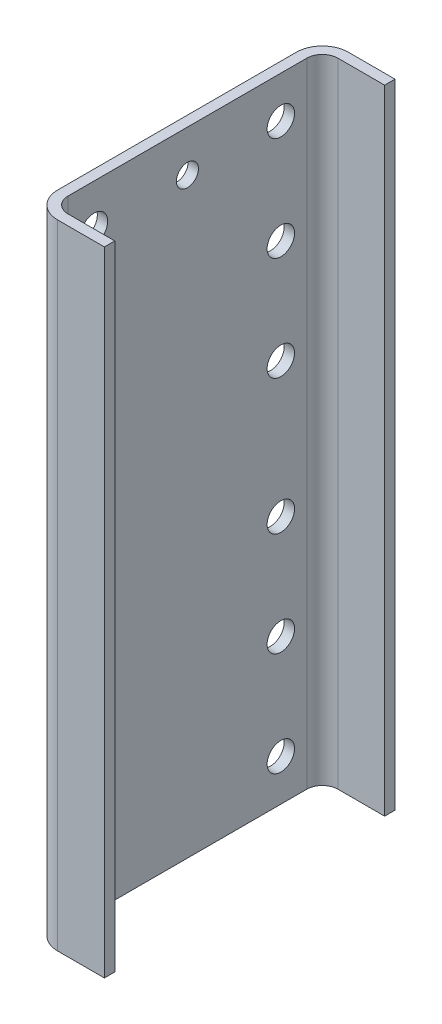
ISO-10303-21;
HEADER;
FILE_DESCRIPTION(('STEP AP214'),'2;1');
FILE_NAME('part.step','',(''),(''),'','','');
FILE_SCHEMA(('AUTOMOTIVE_DESIGN { 1 0 10303 214 1 1 1 1 }'));
ENDSEC;
DATA;
#1=APPLICATION_CONTEXT('core data for automotive mechanical design processes');
#2=APPLICATION_PROTOCOL_DEFINITION('international standard','automotive_design',2000,#1);
#3=PRODUCT_CONTEXT('',#1,'mechanical');
#4=PRODUCT('Part','Part','',(#3));
#5=PRODUCT_RELATED_PRODUCT_CATEGORY('part','',(#4));
#6=PRODUCT_DEFINITION_FORMATION('','',#4);
#7=PRODUCT_DEFINITION_CONTEXT('part definition',#1,'design');
#8=PRODUCT_DEFINITION('design','',#6,#7);
#9=PRODUCT_DEFINITION_SHAPE('','',#8);
#10=(LENGTH_UNIT() NAMED_UNIT(*) SI_UNIT(.MILLI.,.METRE.));
#11=(NAMED_UNIT(*) PLANE_ANGLE_UNIT() SI_UNIT($,.RADIAN.));
#12=(NAMED_UNIT(*) SI_UNIT($,.STERADIAN.) SOLID_ANGLE_UNIT());
#13=UNCERTAINTY_MEASURE_WITH_UNIT(LENGTH_MEASURE(1.E-05),#10,'distance_accuracy_value','');
#14=(GEOMETRIC_REPRESENTATION_CONTEXT(3) GLOBAL_UNCERTAINTY_ASSIGNED_CONTEXT((#13)) GLOBAL_UNIT_ASSIGNED_CONTEXT((#10,
#11,#12)) REPRESENTATION_CONTEXT('',''));
#15=CARTESIAN_POINT('',(0.,0.,0.));
#16=DIRECTION('',(0.,0.,1.));
#17=DIRECTION('',(1.,0.,0.));
#18=AXIS2_PLACEMENT_3D('',#15,#16,#17);
#19=CARTESIAN_POINT('',(3.38618022510673E-12,193.675000000002,73.0249999999997));
#20=DIRECTION('',(1.00000000000001,0.,0.));
#21=DIRECTION('',(0.,0.,-1.00000000000001));
#22=AXIS2_PLACEMENT_3D('',#19,#20,#21);
#23=PLANE('',#22);
#24=CARTESIAN_POINT('',(1.38777878078145E-12,168.275,57.1500000000003));
#25=DIRECTION('',(1.00000000000001,0.,0.));
#26=DIRECTION('',(0.,0.,1.00000000000001));
#27=AXIS2_PLACEMENT_3D('',#24,#25,#26);
#28=CIRCLE('',#27,8.38200000000002);
#29=CARTESIAN_POINT('',(1.38807562499457E-12,168.275,65.5320000000003));
#30=VERTEX_POINT('',#29);
#31=EDGE_CURVE('E261',#30,#30,#28,.T.);
#32=ORIENTED_EDGE('',*,*,#31,.T.);
#33=EDGE_LOOP('',(#32));
#34=FACE_BOUND('',#33,.T.);
#35=CARTESIAN_POINT('',(4.9960036108132E-13,41.2750000000001,57.15));
#36=DIRECTION('',(1.00000000000001,0.,0.));
#37=DIRECTION('',(0.,0.,1.00000000000001));
#38=AXIS2_PLACEMENT_3D('',#35,#36,#37);
#39=CIRCLE('',#38,8.38200000000002);
#40=CARTESIAN_POINT('',(4.99897205294446E-13,41.2750000000001,65.5320000000001));
#41=VERTEX_POINT('',#40);
#42=EDGE_CURVE('E255',#41,#41,#39,.T.);
#43=ORIENTED_EDGE('',*,*,#42,.T.);
#44=EDGE_LOOP('',(#43));
#45=FACE_BOUND('',#44,.T.);
#46=CARTESIAN_POINT('',(4.9960036108132E-13,-104.775000000001,57.15));
#47=DIRECTION('',(1.00000000000001,0.,0.));
#48=DIRECTION('',(0.,0.,1.00000000000001));
#49=AXIS2_PLACEMENT_3D('',#46,#47,#48);
#50=CIRCLE('',#49,8.38200000000001);
#51=CARTESIAN_POINT('',(4.99897205294446E-13,-104.775000000001,65.5320000000001));
#52=VERTEX_POINT('',#51);
#53=EDGE_CURVE('E247',#52,#52,#50,.T.);
#54=ORIENTED_EDGE('',*,*,#53,.T.);
#55=EDGE_LOOP('',(#54));
#56=FACE_BOUND('',#55,.T.);
#57=CARTESIAN_POINT('',(4.9960036108132E-13,-168.275000000001,-57.1500000000023));
#58=DIRECTION('',(1.00000000000001,0.,0.));
#59=DIRECTION('',(0.,0.,-1.00000000000001));
#60=AXIS2_PLACEMENT_3D('',#57,#58,#59);
#61=CIRCLE('',#60,8.38200000000002);
#62=CARTESIAN_POINT('',(4.99303516868195E-13,-168.275000000001,-65.5320000000023));
#63=VERTEX_POINT('',#62);
#64=EDGE_CURVE('E239',#63,#63,#61,.T.);
#65=ORIENTED_EDGE('',*,*,#64,.T.);
#66=EDGE_LOOP('',(#65));
#67=FACE_BOUND('',#66,.T.);
#68=CARTESIAN_POINT('',(-1.66533453693773E-13,-41.275,-57.1500000000003));
#69=DIRECTION('',(1.00000000000001,0.,0.));
#70=DIRECTION('',(0.,0.,-1.00000000000001));
#71=AXIS2_PLACEMENT_3D('',#68,#69,#70);
#72=CIRCLE('',#71,8.382);
#73=CARTESIAN_POINT('',(-1.66830297906899E-13,-41.275,-65.5320000000003));
#74=VERTEX_POINT('',#73);
#75=EDGE_CURVE('E231',#74,#74,#72,.T.);
#76=ORIENTED_EDGE('',*,*,#75,.T.);
#77=EDGE_LOOP('',(#76));
#78=FACE_BOUND('',#77,.T.);
#79=CARTESIAN_POINT('',(4.9960036108132E-13,104.775000000001,-57.1500000000023));
#80=DIRECTION('',(1.00000000000001,0.,0.));
#81=DIRECTION('',(0.,0.,-1.00000000000001));
#82=AXIS2_PLACEMENT_3D('',#79,#80,#81);
#83=CIRCLE('',#82,8.38200000000001);
#84=CARTESIAN_POINT('',(4.99303516868195E-13,104.775000000001,-65.5320000000023));
#85=VERTEX_POINT('',#84);
#86=EDGE_CURVE('E223',#85,#85,#83,.T.);
#87=ORIENTED_EDGE('',*,*,#86,.T.);
#88=EDGE_LOOP('',(#87));
#89=FACE_BOUND('',#88,.T.);
#90=DIRECTION('',(0.,-1.00000000000001,0.));
#91=VECTOR('',#90,1.);
#92=CARTESIAN_POINT('',(2.94209101525666E-12,193.675000000002,-73.0249999999995));
#93=LINE('',#92,#91);
#94=CARTESIAN_POINT('',(2.94209101525666E-12,193.675000000002,-73.0249999999995));
#95=VERTEX_POINT('',#94);
#96=CARTESIAN_POINT('',(-3.88578058618805E-13,-193.675000000002,-73.0250000000017));
#97=VERTEX_POINT('',#96);
#98=EDGE_CURVE('E11',#95,#97,#93,.T.);
#99=ORIENTED_EDGE('',*,*,#98,.T.);
#100=DIRECTION('',(0.,0.,1.00000000000001));
#101=VECTOR('',#100,1.);
#102=CARTESIAN_POINT('',(-1.66533453693773E-13,-193.675000000002,73.0249999999972));
#103=LINE('',#102,#101);
#104=CARTESIAN_POINT('',(-1.66533453693773E-13,-193.675000000002,73.0249999999972));
#105=VERTEX_POINT('',#104);
#106=EDGE_CURVE('E127',#97,#105,#103,.T.);
#107=ORIENTED_EDGE('',*,*,#106,.T.);
#108=DIRECTION('',(0.,-1.00000000000001,0.));
#109=VECTOR('',#108,1.);
#110=CARTESIAN_POINT('',(3.38618022510673E-12,193.675000000002,73.0249999999997));
#111=LINE('',#110,#109);
#112=CARTESIAN_POINT('',(3.38618022510673E-12,193.675000000002,73.0249999999997));
#113=VERTEX_POINT('',#112);
#114=EDGE_CURVE('E43',#113,#105,#111,.T.);
#115=ORIENTED_EDGE('',*,*,#114,.F.);
#116=DIRECTION('',(0.,0.,1.00000000000001));
#117=VECTOR('',#116,1.);
#118=CARTESIAN_POINT('',(3.38618022510673E-12,193.675000000002,73.0249999999997));
#119=LINE('',#118,#117);
#120=EDGE_CURVE('E128',#95,#113,#119,.T.);
#121=ORIENTED_EDGE('',*,*,#120,.F.);
#122=EDGE_LOOP('',(#99,#107,#115,#121));
#123=FACE_BOUND('',#122,.T.);
#124=CARTESIAN_POINT('',(4.9960036108132E-13,41.2749999999999,-57.15));
#125=DIRECTION('',(1.00000000000001,0.,0.));
#126=DIRECTION('',(0.,0.,-1.00000000000001));
#127=AXIS2_PLACEMENT_3D('',#124,#125,#126);
#128=CIRCLE('',#127,8.38200000000002);
#129=CARTESIAN_POINT('',(4.99303516868195E-13,41.2749999999999,-65.5320000000001));
#130=VERTEX_POINT('',#129);
#131=EDGE_CURVE('E147',#130,#130,#128,.T.);
#132=ORIENTED_EDGE('',*,*,#131,.T.);
#133=EDGE_LOOP('',(#132));
#134=FACE_BOUND('',#133,.T.);
#135=CARTESIAN_POINT('',(2.05391259555654E-12,168.275000000001,-57.1500000000003));
#136=DIRECTION('',(1.00000000000001,0.,0.));
#137=DIRECTION('',(0.,0.,-1.00000000000001));
#138=AXIS2_PLACEMENT_3D('',#135,#136,#137);
#139=CIRCLE('',#138,8.38200000000002);
#140=CARTESIAN_POINT('',(2.05361575134341E-12,168.275000000001,-65.5320000000003));
#141=VERTEX_POINT('',#140);
#142=EDGE_CURVE('E227',#141,#141,#139,.T.);
#143=ORIENTED_EDGE('',*,*,#142,.T.);
#144=EDGE_LOOP('',(#143));
#145=FACE_BOUND('',#144,.T.);
#146=CARTESIAN_POINT('',(4.9960036108132E-13,-104.775000000001,-57.1500000000023));
#147=DIRECTION('',(1.00000000000001,0.,0.));
#148=DIRECTION('',(0.,0.,-1.00000000000001));
#149=AXIS2_PLACEMENT_3D('',#146,#147,#148);
#150=CIRCLE('',#149,8.38200000000001);
#151=CARTESIAN_POINT('',(4.99303516868195E-13,-104.775000000001,-65.5320000000023));
#152=VERTEX_POINT('',#151);
#153=EDGE_CURVE('E235',#152,#152,#150,.T.);
#154=ORIENTED_EDGE('',*,*,#153,.T.);
#155=EDGE_LOOP('',(#154));
#156=FACE_BOUND('',#155,.T.);
#157=CARTESIAN_POINT('',(-1.66533453693773E-13,-168.275000000001,57.15));
#158=DIRECTION('',(1.00000000000001,0.,0.));
#159=DIRECTION('',(0.,0.,1.00000000000001));
#160=AXIS2_PLACEMENT_3D('',#157,#158,#159);
#161=CIRCLE('',#160,8.38200000000002);
#162=CARTESIAN_POINT('',(-1.66236609480648E-13,-168.275000000001,65.5320000000001));
#163=VERTEX_POINT('',#162);
#164=EDGE_CURVE('E243',#163,#163,#161,.T.);
#165=ORIENTED_EDGE('',*,*,#164,.T.);
#166=EDGE_LOOP('',(#165));
#167=FACE_BOUND('',#166,.T.);
#168=CARTESIAN_POINT('',(-1.66533453693773E-13,-41.2749999999997,57.1499999999998));
#169=DIRECTION('',(1.00000000000001,0.,0.));
#170=DIRECTION('',(0.,0.,1.00000000000001));
#171=AXIS2_PLACEMENT_3D('',#168,#169,#170);
#172=CIRCLE('',#171,8.382);
#173=CARTESIAN_POINT('',(-1.66236609480648E-13,-41.2749999999997,65.5319999999999));
#174=VERTEX_POINT('',#173);
#175=EDGE_CURVE('E251',#174,#174,#172,.T.);
#176=ORIENTED_EDGE('',*,*,#175,.T.);
#177=EDGE_LOOP('',(#176));
#178=FACE_BOUND('',#177,.T.);
#179=CARTESIAN_POINT('',(4.9960036108132E-13,104.775,57.15));
#180=DIRECTION('',(1.00000000000001,0.,0.));
#181=DIRECTION('',(0.,0.,1.00000000000001));
#182=AXIS2_PLACEMENT_3D('',#179,#180,#181);
#183=CIRCLE('',#182,8.38200000000001);
#184=CARTESIAN_POINT('',(4.99897205294446E-13,104.775,65.5320000000001));
#185=VERTEX_POINT('',#184);
#186=EDGE_CURVE('E258',#185,#185,#183,.T.);
#187=ORIENTED_EDGE('',*,*,#186,.T.);
#188=EDGE_LOOP('',(#187));
#189=FACE_BOUND('',#188,.T.);
#190=CARTESIAN_POINT('',(2.05391259555654E-12,168.275000000001,-2.22044604925031E-13));
#191=DIRECTION('',(1.00000000000001,0.,0.));
#192=DIRECTION('',(0.,0.,-1.00000000000001));
#193=AXIS2_PLACEMENT_3D('',#190,#191,#192);
#194=CIRCLE('',#193,6.731);
#195=CARTESIAN_POINT('',(2.05367422065812E-12,168.275000000001,-6.73100000000027));
#196=VERTEX_POINT('',#195);
#197=EDGE_CURVE('E271',#196,#196,#194,.T.);
#198=ORIENTED_EDGE('',*,*,#197,.T.);
#199=EDGE_LOOP('',(#198));
#200=FACE_BOUND('',#199,.T.);
#201=ADVANCED_FACE('F34',(#34,#45,#56,#67,#78,#89,#123,#134,#145,#156,#167,#178,#189,#200),#23,.F.);
#202=CARTESIAN_POINT('',(6.35000000000302,193.675000000002,-73.0249999999995));
#203=DIRECTION('',(-1.00000000000001,0.,0.));
#204=DIRECTION('',(0.,0.,1.00000000000001));
#205=AXIS2_PLACEMENT_3D('',#202,#203,#204);
#206=PLANE('',#205);
#207=CARTESIAN_POINT('',(6.35000000000147,168.275,57.1500000000003));
#208=DIRECTION('',(-1.00000000000001,0.,0.));
#209=DIRECTION('',(0.,0.,1.00000000000001));
#210=AXIS2_PLACEMENT_3D('',#207,#208,#209);
#211=CIRCLE('',#210,8.38200000000002);
#212=CARTESIAN_POINT('',(6.35000000000147,168.275,65.5320000000003));
#213=VERTEX_POINT('',#212);
#214=EDGE_CURVE('E259',#213,#213,#211,.F.);
#215=ORIENTED_EDGE('',*,*,#214,.F.);
#216=EDGE_LOOP('',(#215));
#217=FACE_BOUND('',#216,.T.);
#218=CARTESIAN_POINT('',(6.35000000000058,41.275,57.15));
#219=DIRECTION('',(-1.00000000000001,0.,0.));
#220=DIRECTION('',(0.,0.,1.00000000000001));
#221=AXIS2_PLACEMENT_3D('',#218,#219,#220);
#222=CIRCLE('',#221,8.38200000000002);
#223=CARTESIAN_POINT('',(6.35000000000058,41.275,65.5320000000001));
#224=VERTEX_POINT('',#223);
#225=EDGE_CURVE('E252',#224,#224,#222,.F.);
#226=ORIENTED_EDGE('',*,*,#225,.F.);
#227=EDGE_LOOP('',(#226));
#228=FACE_BOUND('',#227,.T.);
#229=CARTESIAN_POINT('',(6.35000000000058,-104.775000000001,57.15));
#230=DIRECTION('',(-1.00000000000001,0.,0.));
#231=DIRECTION('',(0.,0.,1.00000000000001));
#232=AXIS2_PLACEMENT_3D('',#229,#230,#231);
#233=CIRCLE('',#232,8.38200000000001);
#234=CARTESIAN_POINT('',(6.35000000000058,-104.775000000001,65.5320000000001));
#235=VERTEX_POINT('',#234);
#236=EDGE_CURVE('E244',#235,#235,#233,.F.);
#237=ORIENTED_EDGE('',*,*,#236,.F.);
#238=EDGE_LOOP('',(#237));
#239=FACE_BOUND('',#238,.T.);
#240=CARTESIAN_POINT('',(6.35000000000058,-168.275000000001,-57.1500000000023));
#241=DIRECTION('',(-1.00000000000001,0.,0.));
#242=DIRECTION('',(0.,0.,1.00000000000001));
#243=AXIS2_PLACEMENT_3D('',#240,#241,#242);
#244=CIRCLE('',#243,8.38200000000002);
#245=CARTESIAN_POINT('',(6.35000000000058,-168.275000000001,-48.7680000000022));
#246=VERTEX_POINT('',#245);
#247=EDGE_CURVE('E236',#246,#246,#244,.F.);
#248=ORIENTED_EDGE('',*,*,#247,.F.);
#249=EDGE_LOOP('',(#248));
#250=FACE_BOUND('',#249,.T.);
#251=CARTESIAN_POINT('',(6.34999999999991,-41.2750000000001,-57.1500000000003));
#252=DIRECTION('',(-1.00000000000001,0.,0.));
#253=DIRECTION('',(0.,0.,1.00000000000001));
#254=AXIS2_PLACEMENT_3D('',#251,#252,#253);
#255=CIRCLE('',#254,8.382);
#256=CARTESIAN_POINT('',(6.34999999999991,-41.2750000000001,-48.7680000000002));
#257=VERTEX_POINT('',#256);
#258=EDGE_CURVE('E228',#257,#257,#255,.F.);
#259=ORIENTED_EDGE('',*,*,#258,.F.);
#260=EDGE_LOOP('',(#259));
#261=FACE_BOUND('',#260,.T.);
#262=CARTESIAN_POINT('',(6.35000000000035,104.775000000001,-57.1500000000023));
#263=DIRECTION('',(-1.00000000000001,0.,0.));
#264=DIRECTION('',(0.,0.,1.00000000000001));
#265=AXIS2_PLACEMENT_3D('',#262,#263,#264);
#266=CIRCLE('',#265,8.38200000000001);
#267=CARTESIAN_POINT('',(6.35000000000036,104.775000000001,-48.7680000000022));
#268=VERTEX_POINT('',#267);
#269=EDGE_CURVE('E220',#268,#268,#266,.F.);
#270=ORIENTED_EDGE('',*,*,#269,.F.);
#271=EDGE_LOOP('',(#270));
#272=FACE_BOUND('',#271,.T.);
#273=DIRECTION('',(0.,-1.00000000000001,0.));
#274=VECTOR('',#273,1.);
#275=CARTESIAN_POINT('',(6.35000000000346,193.675000000002,73.0249999999997));
#276=LINE('',#275,#274);
#277=CARTESIAN_POINT('',(6.35000000000346,193.675000000002,73.0249999999997));
#278=VERTEX_POINT('',#277);
#279=CARTESIAN_POINT('',(6.34999999999991,-193.675000000002,73.0249999999972));
#280=VERTEX_POINT('',#279);
#281=EDGE_CURVE('E209',#278,#280,#276,.T.);
#282=ORIENTED_EDGE('',*,*,#281,.T.);
#283=DIRECTION('',(0.,0.,-1.00000000000001));
#284=VECTOR('',#283,1.);
#285=CARTESIAN_POINT('',(6.34999999999947,-193.675000000002,-73.0250000000017));
#286=LINE('',#285,#284);
#287=CARTESIAN_POINT('',(6.34999999999947,-193.675000000002,-73.0250000000017));
#288=VERTEX_POINT('',#287);
#289=EDGE_CURVE('E165',#280,#288,#286,.T.);
#290=ORIENTED_EDGE('',*,*,#289,.T.);
#291=DIRECTION('',(0.,-1.00000000000001,0.));
#292=VECTOR('',#291,1.);
#293=CARTESIAN_POINT('',(6.35000000000302,193.675000000002,-73.0249999999995));
#294=LINE('',#293,#292);
#295=CARTESIAN_POINT('',(6.35000000000302,193.675000000002,-73.0249999999995));
#296=VERTEX_POINT('',#295);
#297=EDGE_CURVE('E207',#296,#288,#294,.T.);
#298=ORIENTED_EDGE('',*,*,#297,.F.);
#299=DIRECTION('',(0.,0.,-1.00000000000001));
#300=VECTOR('',#299,1.);
#301=CARTESIAN_POINT('',(6.35000000000302,193.675000000002,-73.0249999999995));
#302=LINE('',#301,#300);
#303=EDGE_CURVE('E192',#278,#296,#302,.T.);
#304=ORIENTED_EDGE('',*,*,#303,.F.);
#305=EDGE_LOOP('',(#282,#290,#298,#304));
#306=FACE_BOUND('',#305,.T.);
#307=CARTESIAN_POINT('',(6.35000000000035,41.2749999999998,-57.15));
#308=DIRECTION('',(-1.00000000000001,0.,0.));
#309=DIRECTION('',(0.,0.,1.00000000000001));
#310=AXIS2_PLACEMENT_3D('',#307,#308,#309);
#311=CIRCLE('',#310,8.38200000000002);
#312=CARTESIAN_POINT('',(6.35000000000036,41.2749999999998,-48.768));
#313=VERTEX_POINT('',#312);
#314=EDGE_CURVE('E144',#313,#313,#311,.F.);
#315=ORIENTED_EDGE('',*,*,#314,.F.);
#316=EDGE_LOOP('',(#315));
#317=FACE_BOUND('',#316,.T.);
#318=CARTESIAN_POINT('',(6.35000000000191,168.275000000001,-57.1500000000003));
#319=DIRECTION('',(-1.00000000000001,0.,0.));
#320=DIRECTION('',(0.,0.,1.00000000000001));
#321=AXIS2_PLACEMENT_3D('',#318,#319,#320);
#322=CIRCLE('',#321,8.38200000000002);
#323=CARTESIAN_POINT('',(6.35000000000191,168.275000000001,-48.7680000000002));
#324=VERTEX_POINT('',#323);
#325=EDGE_CURVE('E224',#324,#324,#322,.F.);
#326=ORIENTED_EDGE('',*,*,#325,.F.);
#327=EDGE_LOOP('',(#326));
#328=FACE_BOUND('',#327,.T.);
#329=CARTESIAN_POINT('',(6.35000000000058,-104.775000000001,-57.1500000000023));
#330=DIRECTION('',(-1.00000000000001,0.,0.));
#331=DIRECTION('',(0.,0.,1.00000000000001));
#332=AXIS2_PLACEMENT_3D('',#329,#330,#331);
#333=CIRCLE('',#332,8.38200000000001);
#334=CARTESIAN_POINT('',(6.35000000000058,-104.775000000001,-48.7680000000022));
#335=VERTEX_POINT('',#334);
#336=EDGE_CURVE('E232',#335,#335,#333,.F.);
#337=ORIENTED_EDGE('',*,*,#336,.F.);
#338=EDGE_LOOP('',(#337));
#339=FACE_BOUND('',#338,.T.);
#340=CARTESIAN_POINT('',(6.34999999999991,-168.275000000001,57.15));
#341=DIRECTION('',(-1.00000000000001,0.,0.));
#342=DIRECTION('',(0.,0.,1.00000000000001));
#343=AXIS2_PLACEMENT_3D('',#340,#341,#342);
#344=CIRCLE('',#343,8.38200000000002);
#345=CARTESIAN_POINT('',(6.34999999999991,-168.275000000001,65.5320000000001));
#346=VERTEX_POINT('',#345);
#347=EDGE_CURVE('E240',#346,#346,#344,.F.);
#348=ORIENTED_EDGE('',*,*,#347,.F.);
#349=EDGE_LOOP('',(#348));
#350=FACE_BOUND('',#349,.T.);
#351=CARTESIAN_POINT('',(6.34999999999991,-41.2749999999999,57.1499999999998));
#352=DIRECTION('',(-1.00000000000001,0.,0.));
#353=DIRECTION('',(0.,0.,1.00000000000001));
#354=AXIS2_PLACEMENT_3D('',#351,#352,#353);
#355=CIRCLE('',#354,8.382);
#356=CARTESIAN_POINT('',(6.34999999999991,-41.2749999999999,65.5319999999999));
#357=VERTEX_POINT('',#356);
#358=EDGE_CURVE('E248',#357,#357,#355,.F.);
#359=ORIENTED_EDGE('',*,*,#358,.F.);
#360=EDGE_LOOP('',(#359));
#361=FACE_BOUND('',#360,.T.);
#362=CARTESIAN_POINT('',(6.35000000000058,104.775,57.15));
#363=DIRECTION('',(-1.00000000000001,0.,0.));
#364=DIRECTION('',(0.,0.,1.00000000000001));
#365=AXIS2_PLACEMENT_3D('',#362,#363,#364);
#366=CIRCLE('',#365,8.38200000000001);
#367=CARTESIAN_POINT('',(6.35000000000058,104.775,65.5320000000001));
#368=VERTEX_POINT('',#367);
#369=EDGE_CURVE('E256',#368,#368,#366,.F.);
#370=ORIENTED_EDGE('',*,*,#369,.F.);
#371=EDGE_LOOP('',(#370));
#372=FACE_BOUND('',#371,.T.);
#373=CARTESIAN_POINT('',(6.35000000000213,168.275000000001,-2.22044604925031E-13));
#374=DIRECTION('',(-1.00000000000001,0.,0.));
#375=DIRECTION('',(0.,0.,1.00000000000001));
#376=AXIS2_PLACEMENT_3D('',#373,#374,#375);
#377=CIRCLE('',#376,6.731);
#378=CARTESIAN_POINT('',(6.35000000000213,168.275000000001,6.73099999999982));
#379=VERTEX_POINT('',#378);
#380=EDGE_CURVE('E38',#379,#379,#377,.F.);
#381=ORIENTED_EDGE('',*,*,#380,.F.);
#382=EDGE_LOOP('',(#381));
#383=FACE_BOUND('',#382,.T.);
#384=ADVANCED_FACE('F301',(#217,#228,#239,#250,#261,#272,#306,#317,#328,#339,#350,#361,#372,
#383),#206,.F.);
#385=CARTESIAN_POINT('',(15.875000000003,193.675000000002,-73.0249999999995));
#386=DIRECTION('',(0.,-1.00000000000001,0.));
#387=DIRECTION('',(0.,0.,-1.00000000000001));
#388=AXIS2_PLACEMENT_3D('',#385,#386,#387);
#389=CYLINDRICAL_SURFACE('',#388,15.875);
#390=DIRECTION('',(0.,-1.00000000000001,0.));
#391=VECTOR('',#390,1.);
#392=CARTESIAN_POINT('',(15.875000000003,193.675000000002,-88.9000000000006));
#393=LINE('',#392,#391);
#394=CARTESIAN_POINT('',(15.875000000003,193.675000000002,-88.9000000000006));
#395=VERTEX_POINT('',#394);
#396=CARTESIAN_POINT('',(15.8749999999999,-193.675000000002,-88.9000000000029));
#397=VERTEX_POINT('',#396);
#398=EDGE_CURVE('E143',#395,#397,#393,.T.);
#399=ORIENTED_EDGE('',*,*,#398,.T.);
#400=CARTESIAN_POINT('',(15.8749999999995,-193.675000000002,-73.0250000000017));
#401=DIRECTION('',(0.,1.00000000000001,0.));
#402=DIRECTION('',(0.,0.,-1.00000000000001));
#403=AXIS2_PLACEMENT_3D('',#400,#401,#402);
#404=CIRCLE('',#403,15.875);
#405=EDGE_CURVE('E137',#397,#97,#404,.T.);
#406=ORIENTED_EDGE('',*,*,#405,.T.);
#407=ORIENTED_EDGE('',*,*,#98,.F.);
#408=CARTESIAN_POINT('',(15.875000000003,193.675000000002,-73.0249999999995));
#409=DIRECTION('',(0.,1.00000000000001,0.));
#410=DIRECTION('',(0.,0.,-1.00000000000001));
#411=AXIS2_PLACEMENT_3D('',#408,#409,#410);
#412=CIRCLE('',#411,15.875);
#413=EDGE_CURVE('E179',#395,#95,#412,.T.);
#414=ORIENTED_EDGE('',*,*,#413,.F.);
#415=EDGE_LOOP('',(#399,#406,#407,#414));
#416=FACE_BOUND('',#415,.T.);
#417=ADVANCED_FACE('F36',(#416),#389,.T.);
#418=CARTESIAN_POINT('',(15.8750000000035,193.675000000002,73.0249999999997));
#419=DIRECTION('',(0.,-1.00000000000001,0.));
#420=DIRECTION('',(0.,0.,-1.00000000000001));
#421=AXIS2_PLACEMENT_3D('',#418,#419,#420);
#422=CYLINDRICAL_SURFACE('',#421,15.875);
#423=ORIENTED_EDGE('',*,*,#114,.T.);
#424=CARTESIAN_POINT('',(15.8749999999999,-193.675000000002,73.0249999999972));
#425=DIRECTION('',(0.,1.00000000000001,0.));
#426=DIRECTION('',(0.,0.,1.00000000000001));
#427=AXIS2_PLACEMENT_3D('',#424,#425,#426);
#428=CIRCLE('',#427,15.875);
#429=CARTESIAN_POINT('',(15.8749999999999,-193.675000000001,88.8999999999984));
#430=VERTEX_POINT('',#429);
#431=EDGE_CURVE('E141',#105,#430,#428,.T.);
#432=ORIENTED_EDGE('',*,*,#431,.T.);
#433=DIRECTION('',(0.,-1.00000000000001,0.));
#434=VECTOR('',#433,1.);
#435=CARTESIAN_POINT('',(15.8750000000028,193.675000000002,88.9000000000009));
#436=LINE('',#435,#434);
#437=CARTESIAN_POINT('',(15.8750000000028,193.675000000002,88.9000000000009));
#438=VERTEX_POINT('',#437);
#439=EDGE_CURVE('E217',#438,#430,#436,.T.);
#440=ORIENTED_EDGE('',*,*,#439,.F.);
#441=CARTESIAN_POINT('',(15.8750000000035,193.675000000002,73.0249999999997));
#442=DIRECTION('',(0.,1.00000000000001,0.));
#443=DIRECTION('',(0.,0.,1.00000000000001));
#444=AXIS2_PLACEMENT_3D('',#441,#442,#443);
#445=CIRCLE('',#444,15.875);
#446=EDGE_CURVE('E182',#113,#438,#445,.T.);
#447=ORIENTED_EDGE('',*,*,#446,.F.);
#448=EDGE_LOOP('',(#423,#432,#440,#447));
#449=FACE_BOUND('',#448,.T.);
#450=ADVANCED_FACE('F341',(#449),#422,.T.);
#451=CARTESIAN_POINT('',(15.8750000000028,193.675000000002,88.9000000000009));
#452=DIRECTION('',(0.,0.,-1.00000000000001));
#453=DIRECTION('',(-1.00000000000001,0.,0.));
#454=AXIS2_PLACEMENT_3D('',#451,#452,#453);
#455=PLANE('',#454);
#456=ORIENTED_EDGE('',*,*,#439,.T.);
#457=DIRECTION('',(1.00000000000001,0.,0.));
#458=VECTOR('',#457,1.);
#459=CARTESIAN_POINT('',(15.8749999999999,-193.675000000001,88.8999999999984));
#460=LINE('',#459,#458);
#461=CARTESIAN_POINT('',(44.4499999999999,-193.675000000001,88.8999999999984));
#462=VERTEX_POINT('',#461);
#463=EDGE_CURVE('E153',#430,#462,#460,.T.);
#464=ORIENTED_EDGE('',*,*,#463,.T.);
#465=DIRECTION('',(0.,-1.00000000000001,0.));
#466=VECTOR('',#465,1.);
#467=CARTESIAN_POINT('',(44.4500000000028,193.675000000002,88.9000000000009));
#468=LINE('',#467,#466);
#469=CARTESIAN_POINT('',(44.4500000000028,193.675000000002,88.9000000000009));
#470=VERTEX_POINT('',#469);
#471=EDGE_CURVE('E215',#470,#462,#468,.T.);
#472=ORIENTED_EDGE('',*,*,#471,.F.);
#473=DIRECTION('',(1.00000000000001,0.,0.));
#474=VECTOR('',#473,1.);
#475=CARTESIAN_POINT('',(15.8750000000028,193.675000000002,88.9000000000009));
#476=LINE('',#475,#474);
#477=EDGE_CURVE('E184',#438,#470,#476,.T.);
#478=ORIENTED_EDGE('',*,*,#477,.F.);
#479=EDGE_LOOP('',(#456,#464,#472,#478));
#480=FACE_BOUND('',#479,.T.);
#481=ADVANCED_FACE('F344',(#480),#455,.F.);
#482=CARTESIAN_POINT('',(44.4500000000028,193.675000000002,88.9000000000009));
#483=DIRECTION('',(-1.00000000000001,0.,0.));
#484=DIRECTION('',(0.,0.,1.00000000000001));
#485=AXIS2_PLACEMENT_3D('',#482,#483,#484);
#486=PLANE('',#485);
#487=ORIENTED_EDGE('',*,*,#471,.T.);
#488=DIRECTION('',(0.,0.,-1.00000000000001));
#489=VECTOR('',#488,1.);
#490=CARTESIAN_POINT('',(44.4499999999999,-193.675000000001,88.8999999999984));
#491=LINE('',#490,#489);
#492=CARTESIAN_POINT('',(44.4499999999999,-193.675000000001,82.5499999999972));
#493=VERTEX_POINT('',#492);
#494=EDGE_CURVE('E156',#462,#493,#491,.T.);
#495=ORIENTED_EDGE('',*,*,#494,.T.);
#496=DIRECTION('',(0.,-1.00000000000001,0.));
#497=VECTOR('',#496,1.);
#498=CARTESIAN_POINT('',(44.4500000000028,193.675000000002,82.5499999999997));
#499=LINE('',#498,#497);
#500=CARTESIAN_POINT('',(44.4500000000028,193.675000000002,82.5499999999997));
#501=VERTEX_POINT('',#500);
#502=EDGE_CURVE('E213',#501,#493,#499,.T.);
#503=ORIENTED_EDGE('',*,*,#502,.F.);
#504=DIRECTION('',(0.,0.,-1.00000000000001));
#505=VECTOR('',#504,1.);
#506=CARTESIAN_POINT('',(44.4500000000028,193.675000000002,88.9000000000009));
#507=LINE('',#506,#505);
#508=EDGE_CURVE('E186',#470,#501,#507,.T.);
#509=ORIENTED_EDGE('',*,*,#508,.F.);
#510=EDGE_LOOP('',(#487,#495,#503,#509));
#511=FACE_BOUND('',#510,.T.);
#512=ADVANCED_FACE('F348',(#511),#486,.F.);
#513=CARTESIAN_POINT('',(44.4500000000028,193.675000000002,82.5499999999997));
#514=DIRECTION('',(0.,0.,1.00000000000001));
#515=DIRECTION('',(1.00000000000001,0.,0.));
#516=AXIS2_PLACEMENT_3D('',#513,#514,#515);
#517=PLANE('',#516);
#518=ORIENTED_EDGE('',*,*,#502,.T.);
#519=DIRECTION('',(-1.00000000000001,0.,0.));
#520=VECTOR('',#519,1.);
#521=CARTESIAN_POINT('',(44.4499999999999,-193.675000000001,82.5499999999972));
#522=LINE('',#521,#520);
#523=CARTESIAN_POINT('',(15.8749999999999,-193.675000000001,82.5499999999972));
#524=VERTEX_POINT('',#523);
#525=EDGE_CURVE('E159',#493,#524,#522,.T.);
#526=ORIENTED_EDGE('',*,*,#525,.T.);
#527=DIRECTION('',(0.,-1.00000000000001,0.));
#528=VECTOR('',#527,1.);
#529=CARTESIAN_POINT('',(15.8750000000035,193.675000000002,82.5499999999997));
#530=LINE('',#529,#528);
#531=CARTESIAN_POINT('',(15.8750000000035,193.675000000002,82.5499999999997));
#532=VERTEX_POINT('',#531);
#533=EDGE_CURVE('E211',#532,#524,#530,.T.);
#534=ORIENTED_EDGE('',*,*,#533,.F.);
#535=DIRECTION('',(-1.00000000000001,0.,0.));
#536=VECTOR('',#535,1.);
#537=CARTESIAN_POINT('',(44.4500000000028,193.675000000002,82.5499999999997));
#538=LINE('',#537,#536);
#539=EDGE_CURVE('E188',#501,#532,#538,.T.);
#540=ORIENTED_EDGE('',*,*,#539,.F.);
#541=EDGE_LOOP('',(#518,#526,#534,#540));
#542=FACE_BOUND('',#541,.T.);
#543=ADVANCED_FACE('F352',(#542),#517,.F.);
#544=CARTESIAN_POINT('',(15.8750000000035,193.675000000002,73.0249999999997));
#545=DIRECTION('',(0.,-1.00000000000001,0.));
#546=DIRECTION('',(0.,0.,-1.00000000000001));
#547=AXIS2_PLACEMENT_3D('',#544,#545,#546);
#548=CYLINDRICAL_SURFACE('',#547,9.525);
#549=ORIENTED_EDGE('',*,*,#533,.T.);
#550=CARTESIAN_POINT('',(15.8749999999999,-193.675000000002,73.0249999999972));
#551=DIRECTION('',(0.,-1.00000000000001,0.));
#552=DIRECTION('',(0.,0.,-1.00000000000001));
#553=AXIS2_PLACEMENT_3D('',#550,#551,#552);
#554=CIRCLE('',#553,9.525);
#555=EDGE_CURVE('E162',#524,#280,#554,.T.);
#556=ORIENTED_EDGE('',*,*,#555,.T.);
#557=ORIENTED_EDGE('',*,*,#281,.F.);
#558=CARTESIAN_POINT('',(15.8750000000035,193.675000000002,73.0249999999997));
#559=DIRECTION('',(0.,-1.00000000000001,0.));
#560=DIRECTION('',(0.,0.,-1.00000000000001));
#561=AXIS2_PLACEMENT_3D('',#558,#559,#560);
#562=CIRCLE('',#561,9.525);
#563=EDGE_CURVE('E190',#532,#278,#562,.T.);
#564=ORIENTED_EDGE('',*,*,#563,.F.);
#565=EDGE_LOOP('',(#549,#556,#557,#564));
#566=FACE_BOUND('',#565,.T.);
#567=ADVANCED_FACE('F356',(#566),#548,.F.);
#568=CARTESIAN_POINT('',(15.875000000003,193.675000000002,-73.0249999999995));
#569=DIRECTION('',(0.,-1.00000000000001,0.));
#570=DIRECTION('',(0.,0.,-1.00000000000001));
#571=AXIS2_PLACEMENT_3D('',#568,#569,#570);
#572=CYLINDRICAL_SURFACE('',#571,9.52500000000001);
#573=ORIENTED_EDGE('',*,*,#297,.T.);
#574=CARTESIAN_POINT('',(15.8749999999995,-193.675000000002,-73.0250000000017));
#575=DIRECTION('',(0.,-1.00000000000001,0.));
#576=DIRECTION('',(0.,0.,1.00000000000001));
#577=AXIS2_PLACEMENT_3D('',#574,#575,#576);
#578=CIRCLE('',#577,9.52500000000001);
#579=CARTESIAN_POINT('',(15.8749999999995,-193.675000000002,-82.5500000000017));
#580=VERTEX_POINT('',#579);
#581=EDGE_CURVE('E168',#288,#580,#578,.T.);
#582=ORIENTED_EDGE('',*,*,#581,.T.);
#583=DIRECTION('',(0.,-1.00000000000001,0.));
#584=VECTOR('',#583,1.);
#585=CARTESIAN_POINT('',(15.875000000003,193.675000000002,-82.5499999999995));
#586=LINE('',#585,#584);
#587=CARTESIAN_POINT('',(15.875000000003,193.675000000002,-82.5499999999995));
#588=VERTEX_POINT('',#587);
#589=EDGE_CURVE('E205',#588,#580,#586,.T.);
#590=ORIENTED_EDGE('',*,*,#589,.F.);
#591=CARTESIAN_POINT('',(15.875000000003,193.675000000002,-73.0249999999995));
#592=DIRECTION('',(0.,-1.00000000000001,0.));
#593=DIRECTION('',(0.,0.,1.00000000000001));
#594=AXIS2_PLACEMENT_3D('',#591,#592,#593);
#595=CIRCLE('',#594,9.52500000000001);
#596=EDGE_CURVE('E194',#296,#588,#595,.T.);
#597=ORIENTED_EDGE('',*,*,#596,.F.);
#598=EDGE_LOOP('',(#573,#582,#590,#597));
#599=FACE_BOUND('',#598,.T.);
#600=ADVANCED_FACE('F359',(#599),#572,.F.);
#601=CARTESIAN_POINT('',(44.450000000003,193.675000000002,-82.5499999999995));
#602=DIRECTION('',(0.,0.,-1.00000000000001));
#603=DIRECTION('',(-1.00000000000001,0.,0.));
#604=AXIS2_PLACEMENT_3D('',#601,#602,#603);
#605=PLANE('',#604);
#606=ORIENTED_EDGE('',*,*,#589,.T.);
#607=DIRECTION('',(1.00000000000001,0.,0.));
#608=VECTOR('',#607,1.);
#609=CARTESIAN_POINT('',(44.4499999999999,-193.675000000002,-82.5500000000017));
#610=LINE('',#609,#608);
#611=CARTESIAN_POINT('',(44.4499999999999,-193.675000000002,-82.5500000000017));
#612=VERTEX_POINT('',#611);
#613=EDGE_CURVE('E171',#580,#612,#610,.T.);
#614=ORIENTED_EDGE('',*,*,#613,.T.);
#615=DIRECTION('',(0.,-1.00000000000001,0.));
#616=VECTOR('',#615,1.);
#617=CARTESIAN_POINT('',(44.450000000003,193.675000000002,-82.5499999999995));
#618=LINE('',#617,#616);
#619=CARTESIAN_POINT('',(44.450000000003,193.675000000002,-82.5499999999995));
#620=VERTEX_POINT('',#619);
#621=EDGE_CURVE('E203',#620,#612,#618,.T.);
#622=ORIENTED_EDGE('',*,*,#621,.F.);
#623=DIRECTION('',(1.00000000000001,0.,0.));
#624=VECTOR('',#623,1.);
#625=CARTESIAN_POINT('',(44.450000000003,193.675000000002,-82.5499999999995));
#626=LINE('',#625,#624);
#627=EDGE_CURVE('E196',#588,#620,#626,.T.);
#628=ORIENTED_EDGE('',*,*,#627,.F.);
#629=EDGE_LOOP('',(#606,#614,#622,#628));
#630=FACE_BOUND('',#629,.T.);
#631=ADVANCED_FACE('F364',(#630),#605,.F.);
#632=CARTESIAN_POINT('',(44.450000000003,193.675000000002,-88.9000000000006));
#633=DIRECTION('',(-1.00000000000001,0.,0.));
#634=DIRECTION('',(0.,0.,1.00000000000001));
#635=AXIS2_PLACEMENT_3D('',#632,#633,#634);
#636=PLANE('',#635);
#637=ORIENTED_EDGE('',*,*,#621,.T.);
#638=DIRECTION('',(0.,0.,-1.00000000000001));
#639=VECTOR('',#638,1.);
#640=CARTESIAN_POINT('',(44.4499999999999,-193.675000000002,-88.9000000000029));
#641=LINE('',#640,#639);
#642=CARTESIAN_POINT('',(44.4499999999999,-193.675000000002,-88.9000000000029));
#643=VERTEX_POINT('',#642);
#644=EDGE_CURVE('E174',#612,#643,#641,.T.);
#645=ORIENTED_EDGE('',*,*,#644,.T.);
#646=DIRECTION('',(0.,-1.00000000000001,0.));
#647=VECTOR('',#646,1.);
#648=CARTESIAN_POINT('',(44.450000000003,193.675000000002,-88.9000000000006));
#649=LINE('',#648,#647);
#650=CARTESIAN_POINT('',(44.450000000003,193.675000000002,-88.9000000000006));
#651=VERTEX_POINT('',#650);
#652=EDGE_CURVE('E201',#651,#643,#649,.T.);
#653=ORIENTED_EDGE('',*,*,#652,.F.);
#654=DIRECTION('',(0.,0.,-1.00000000000001));
#655=VECTOR('',#654,1.);
#656=CARTESIAN_POINT('',(44.450000000003,193.675000000002,-88.9000000000006));
#657=LINE('',#656,#655);
#658=EDGE_CURVE('E56',#620,#651,#657,.T.);
#659=ORIENTED_EDGE('',*,*,#658,.F.);
#660=EDGE_LOOP('',(#637,#645,#653,#659));
#661=FACE_BOUND('',#660,.T.);
#662=ADVANCED_FACE('F368',(#661),#636,.F.);
#663=CARTESIAN_POINT('',(15.875000000003,193.675000000002,-88.9000000000006));
#664=DIRECTION('',(0.,0.,1.00000000000001));
#665=DIRECTION('',(1.00000000000001,0.,0.));
#666=AXIS2_PLACEMENT_3D('',#663,#664,#665);
#667=PLANE('',#666);
#668=ORIENTED_EDGE('',*,*,#652,.T.);
#669=DIRECTION('',(-1.00000000000001,0.,0.));
#670=VECTOR('',#669,1.);
#671=CARTESIAN_POINT('',(15.8749999999999,-193.675000000002,-88.9000000000029));
#672=LINE('',#671,#670);
#673=EDGE_CURVE('E177',#643,#397,#672,.T.);
#674=ORIENTED_EDGE('',*,*,#673,.T.);
#675=ORIENTED_EDGE('',*,*,#398,.F.);
#676=DIRECTION('',(-1.00000000000001,0.,0.));
#677=VECTOR('',#676,1.);
#678=CARTESIAN_POINT('',(15.875000000003,193.675000000002,-88.9000000000006));
#679=LINE('',#678,#677);
#680=EDGE_CURVE('E51',#651,#395,#679,.T.);
#681=ORIENTED_EDGE('',*,*,#680,.F.);
#682=EDGE_LOOP('',(#668,#674,#675,#681));
#683=FACE_BOUND('',#682,.T.);
#684=ADVANCED_FACE('F372',(#683),#667,.F.);
#685=CARTESIAN_POINT('',(15.875000000003,193.675000000002,-73.0249999999995));
#686=DIRECTION('',(0.,-1.00000000000001,0.));
#687=DIRECTION('',(0.,0.,-1.00000000000001));
#688=AXIS2_PLACEMENT_3D('',#685,#686,#687);
#689=PLANE('',#688);
#690=ORIENTED_EDGE('',*,*,#413,.T.);
#691=ORIENTED_EDGE('',*,*,#120,.T.);
#692=ORIENTED_EDGE('',*,*,#446,.T.);
#693=ORIENTED_EDGE('',*,*,#477,.T.);
#694=ORIENTED_EDGE('',*,*,#508,.T.);
#695=ORIENTED_EDGE('',*,*,#539,.T.);
#696=ORIENTED_EDGE('',*,*,#563,.T.);
#697=ORIENTED_EDGE('',*,*,#303,.T.);
#698=ORIENTED_EDGE('',*,*,#596,.T.);
#699=ORIENTED_EDGE('',*,*,#627,.T.);
#700=ORIENTED_EDGE('',*,*,#658,.T.);
#701=ORIENTED_EDGE('',*,*,#680,.T.);
#702=EDGE_LOOP('',(#690,#691,#692,#693,#694,#695,#696,#697,#698,#699,#700,#701));
#703=FACE_BOUND('',#702,.T.);
#704=ADVANCED_FACE('F376',(#703),#689,.F.);
#705=CARTESIAN_POINT('',(15.8749999999995,-193.675000000002,-73.0250000000017));
#706=DIRECTION('',(0.,-1.00000000000001,0.));
#707=DIRECTION('',(0.,0.,-1.00000000000001));
#708=AXIS2_PLACEMENT_3D('',#705,#706,#707);
#709=PLANE('',#708);
#710=ORIENTED_EDGE('',*,*,#405,.F.);
#711=ORIENTED_EDGE('',*,*,#673,.F.);
#712=ORIENTED_EDGE('',*,*,#644,.F.);
#713=ORIENTED_EDGE('',*,*,#613,.F.);
#714=ORIENTED_EDGE('',*,*,#581,.F.);
#715=ORIENTED_EDGE('',*,*,#289,.F.);
#716=ORIENTED_EDGE('',*,*,#555,.F.);
#717=ORIENTED_EDGE('',*,*,#525,.F.);
#718=ORIENTED_EDGE('',*,*,#494,.F.);
#719=ORIENTED_EDGE('',*,*,#463,.F.);
#720=ORIENTED_EDGE('',*,*,#431,.F.);
#721=ORIENTED_EDGE('',*,*,#106,.F.);
#722=EDGE_LOOP('',(#710,#711,#712,#713,#714,#715,#716,#717,#718,#719,#720,#721));
#723=FACE_BOUND('',#722,.T.);
#724=ADVANCED_FACE('F135',(#723),#709,.T.);
#725=CARTESIAN_POINT('',(44.450000000001,41.2749999999999,-57.15));
#726=DIRECTION('',(-1.00000000000001,0.,0.));
#727=DIRECTION('',(0.,0.,1.00000000000001));
#728=AXIS2_PLACEMENT_3D('',#725,#726,#727);
#729=CYLINDRICAL_SURFACE('',#728,8.38200000000002);
#730=ORIENTED_EDGE('',*,*,#131,.F.);
#731=EDGE_LOOP('',(#730));
#732=FACE_BOUND('',#731,.T.);
#733=ORIENTED_EDGE('',*,*,#314,.T.);
#734=EDGE_LOOP('',(#733));
#735=FACE_BOUND('',#734,.T.);
#736=ADVANCED_FACE('F297',(#732,#735),#729,.F.);
#737=CARTESIAN_POINT('',(44.4500000000008,104.775,-57.1500000000023));
#738=DIRECTION('',(-1.00000000000001,0.,0.));
#739=DIRECTION('',(0.,0.,1.00000000000001));
#740=AXIS2_PLACEMENT_3D('',#737,#738,#739);
#741=CYLINDRICAL_SURFACE('',#740,8.38200000000001);
#742=ORIENTED_EDGE('',*,*,#86,.F.);
#743=EDGE_LOOP('',(#742));
#744=FACE_BOUND('',#743,.T.);
#745=ORIENTED_EDGE('',*,*,#269,.T.);
#746=EDGE_LOOP('',(#745));
#747=FACE_BOUND('',#746,.T.);
#748=ADVANCED_FACE('F293',(#744,#747),#741,.F.);
#749=CARTESIAN_POINT('',(44.4500000000022,168.275000000001,-57.1500000000003));
#750=DIRECTION('',(-1.00000000000001,0.,0.));
#751=DIRECTION('',(0.,0.,1.00000000000001));
#752=AXIS2_PLACEMENT_3D('',#749,#750,#751);
#753=CYLINDRICAL_SURFACE('',#752,8.38200000000002);
#754=ORIENTED_EDGE('',*,*,#142,.F.);
#755=EDGE_LOOP('',(#754));
#756=FACE_BOUND('',#755,.T.);
#757=ORIENTED_EDGE('',*,*,#325,.T.);
#758=EDGE_LOOP('',(#757));
#759=FACE_BOUND('',#758,.T.);
#760=ADVANCED_FACE('F296',(#756,#759),#753,.F.);
#761=CARTESIAN_POINT('',(44.4499999999999,-41.2750000000003,-57.1500000000003));
#762=DIRECTION('',(-1.00000000000001,0.,0.));
#763=DIRECTION('',(0.,0.,1.00000000000001));
#764=AXIS2_PLACEMENT_3D('',#761,#762,#763);
#765=CYLINDRICAL_SURFACE('',#764,8.382);
#766=ORIENTED_EDGE('',*,*,#75,.F.);
#767=EDGE_LOOP('',(#766));
#768=FACE_BOUND('',#767,.T.);
#769=ORIENTED_EDGE('',*,*,#258,.T.);
#770=EDGE_LOOP('',(#769));
#771=FACE_BOUND('',#770,.T.);
#772=ADVANCED_FACE('F387',(#768,#771),#765,.F.);
#773=CARTESIAN_POINT('',(44.4500000000006,-104.775000000001,-57.1500000000023));
#774=DIRECTION('',(-1.00000000000001,0.,0.));
#775=DIRECTION('',(0.,0.,1.00000000000001));
#776=AXIS2_PLACEMENT_3D('',#773,#774,#775);
#777=CYLINDRICAL_SURFACE('',#776,8.38200000000001);
#778=ORIENTED_EDGE('',*,*,#153,.F.);
#779=EDGE_LOOP('',(#778));
#780=FACE_BOUND('',#779,.T.);
#781=ORIENTED_EDGE('',*,*,#336,.T.);
#782=EDGE_LOOP('',(#781));
#783=FACE_BOUND('',#782,.T.);
#784=ADVANCED_FACE('F391',(#780,#783),#777,.F.);
#785=CARTESIAN_POINT('',(44.4500000000006,-168.275000000001,-57.1500000000023));
#786=DIRECTION('',(-1.00000000000001,0.,0.));
#787=DIRECTION('',(0.,0.,1.00000000000001));
#788=AXIS2_PLACEMENT_3D('',#785,#786,#787);
#789=CYLINDRICAL_SURFACE('',#788,8.38200000000002);
#790=ORIENTED_EDGE('',*,*,#64,.F.);
#791=EDGE_LOOP('',(#790));
#792=FACE_BOUND('',#791,.T.);
#793=ORIENTED_EDGE('',*,*,#247,.T.);
#794=EDGE_LOOP('',(#793));
#795=FACE_BOUND('',#794,.T.);
#796=ADVANCED_FACE('F395',(#792,#795),#789,.F.);
#797=CARTESIAN_POINT('',(44.4499999999999,-168.275000000001,57.15));
#798=DIRECTION('',(-1.00000000000001,0.,0.));
#799=DIRECTION('',(0.,0.,1.00000000000001));
#800=AXIS2_PLACEMENT_3D('',#797,#798,#799);
#801=CYLINDRICAL_SURFACE('',#800,8.38200000000002);
#802=ORIENTED_EDGE('',*,*,#164,.F.);
#803=EDGE_LOOP('',(#802));
#804=FACE_BOUND('',#803,.T.);
#805=ORIENTED_EDGE('',*,*,#347,.T.);
#806=EDGE_LOOP('',(#805));
#807=FACE_BOUND('',#806,.T.);
#808=ADVANCED_FACE('F399',(#804,#807),#801,.F.);
#809=CARTESIAN_POINT('',(44.4499999999999,-104.775000000001,57.15));
#810=DIRECTION('',(-1.00000000000001,0.,0.));
#811=DIRECTION('',(0.,0.,1.00000000000001));
#812=AXIS2_PLACEMENT_3D('',#809,#810,#811);
#813=CYLINDRICAL_SURFACE('',#812,8.38200000000001);
#814=ORIENTED_EDGE('',*,*,#53,.F.);
#815=EDGE_LOOP('',(#814));
#816=FACE_BOUND('',#815,.T.);
#817=ORIENTED_EDGE('',*,*,#236,.T.);
#818=EDGE_LOOP('',(#817));
#819=FACE_BOUND('',#818,.T.);
#820=ADVANCED_FACE('F403',(#816,#819),#813,.F.);
#821=CARTESIAN_POINT('',(44.4499999999999,-41.2749999999997,57.1499999999998));
#822=DIRECTION('',(-1.00000000000001,0.,0.));
#823=DIRECTION('',(0.,0.,1.00000000000001));
#824=AXIS2_PLACEMENT_3D('',#821,#822,#823);
#825=CYLINDRICAL_SURFACE('',#824,8.382);
#826=ORIENTED_EDGE('',*,*,#175,.F.);
#827=EDGE_LOOP('',(#826));
#828=FACE_BOUND('',#827,.T.);
#829=ORIENTED_EDGE('',*,*,#358,.T.);
#830=EDGE_LOOP('',(#829));
#831=FACE_BOUND('',#830,.T.);
#832=ADVANCED_FACE('F407',(#828,#831),#825,.F.);
#833=CARTESIAN_POINT('',(44.450000000001,41.2750000000001,57.15));
#834=DIRECTION('',(-1.00000000000001,0.,0.));
#835=DIRECTION('',(0.,0.,1.00000000000001));
#836=AXIS2_PLACEMENT_3D('',#833,#834,#835);
#837=CYLINDRICAL_SURFACE('',#836,8.38200000000002);
#838=ORIENTED_EDGE('',*,*,#42,.F.);
#839=EDGE_LOOP('',(#838));
#840=FACE_BOUND('',#839,.T.);
#841=ORIENTED_EDGE('',*,*,#225,.T.);
#842=EDGE_LOOP('',(#841));
#843=FACE_BOUND('',#842,.T.);
#844=ADVANCED_FACE('F411',(#840,#843),#837,.F.);
#845=CARTESIAN_POINT('',(44.4500000000008,104.775,57.15));
#846=DIRECTION('',(-1.00000000000001,0.,0.));
#847=DIRECTION('',(0.,0.,1.00000000000001));
#848=AXIS2_PLACEMENT_3D('',#845,#846,#847);
#849=CYLINDRICAL_SURFACE('',#848,8.38200000000001);
#850=ORIENTED_EDGE('',*,*,#186,.F.);
#851=EDGE_LOOP('',(#850));
#852=FACE_BOUND('',#851,.T.);
#853=ORIENTED_EDGE('',*,*,#369,.T.);
#854=EDGE_LOOP('',(#853));
#855=FACE_BOUND('',#854,.T.);
#856=ADVANCED_FACE('F332',(#852,#855),#849,.F.);
#857=CARTESIAN_POINT('',(44.4500000000017,168.275,57.1500000000003));
#858=DIRECTION('',(-1.00000000000001,0.,0.));
#859=DIRECTION('',(0.,0.,1.00000000000001));
#860=AXIS2_PLACEMENT_3D('',#857,#858,#859);
#861=CYLINDRICAL_SURFACE('',#860,8.38200000000002);
#862=ORIENTED_EDGE('',*,*,#31,.F.);
#863=EDGE_LOOP('',(#862));
#864=FACE_BOUND('',#863,.T.);
#865=ORIENTED_EDGE('',*,*,#214,.T.);
#866=EDGE_LOOP('',(#865));
#867=FACE_BOUND('',#866,.T.);
#868=ADVANCED_FACE('F326',(#864,#867),#861,.F.);
#869=CARTESIAN_POINT('',(44.4500000000017,168.275000000001,-2.22044604925031E-13));
#870=DIRECTION('',(-1.00000000000001,0.,0.));
#871=DIRECTION('',(0.,0.,1.00000000000001));
#872=AXIS2_PLACEMENT_3D('',#869,#870,#871);
#873=CYLINDRICAL_SURFACE('',#872,6.731);
#874=ORIENTED_EDGE('',*,*,#197,.F.);
#875=EDGE_LOOP('',(#874));
#876=FACE_BOUND('',#875,.T.);
#877=ORIENTED_EDGE('',*,*,#380,.T.);
#878=EDGE_LOOP('',(#877));
#879=FACE_BOUND('',#878,.T.);
#880=ADVANCED_FACE('F324',(#876,#879),#873,.F.);
#881=CLOSED_SHELL('',(#201,#384,#417,#450,#481,#512,#543,#567,#600,#631,#662,#684,#704,#724,
#736,#748,#760,#772,#784,#796,#808,#820,#832,#844,#856,#868,#880));
#882=MANIFOLD_SOLID_BREP('B2',#881);
#883=ADVANCED_BREP_SHAPE_REPRESENTATION('',(#18,#882),#14);
#884=SHAPE_DEFINITION_REPRESENTATION(#9,#883);
ENDSEC;
END-ISO-10303-21;
